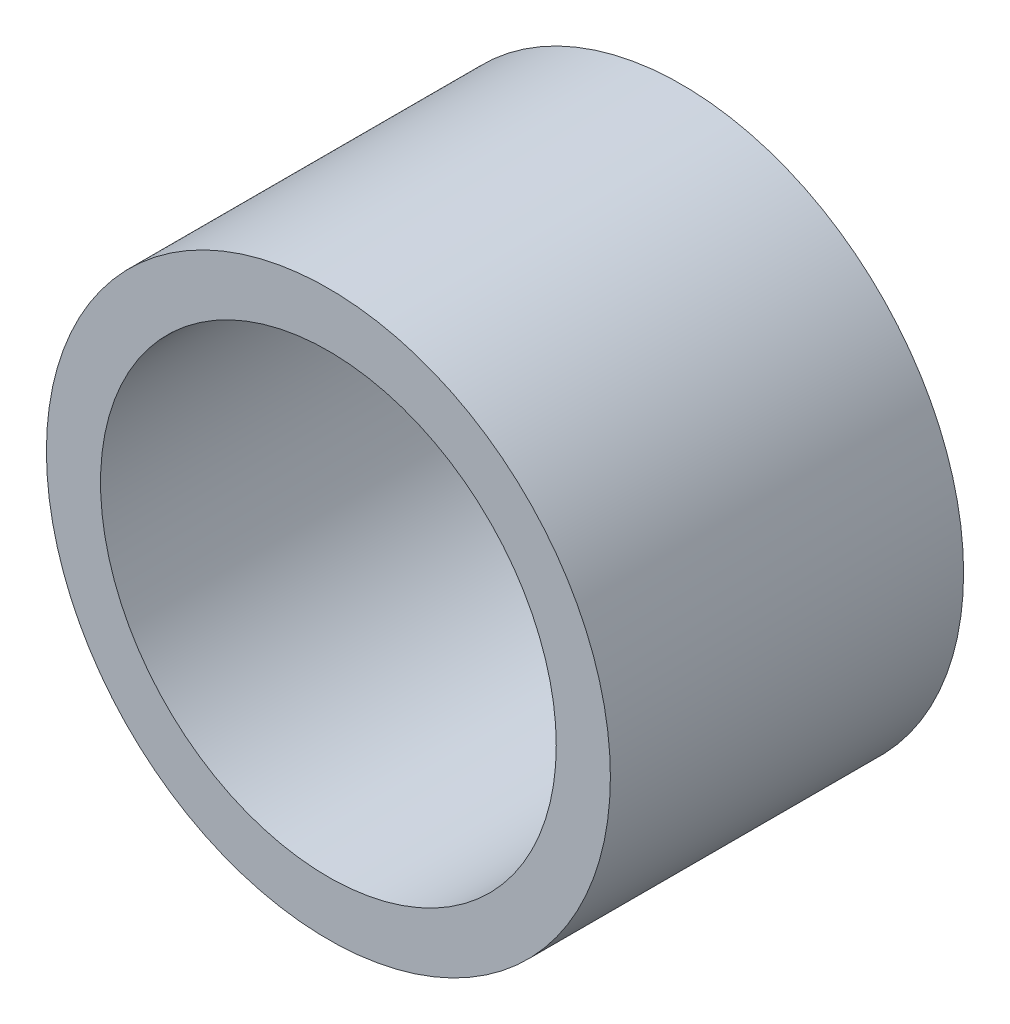
ISO-10303-21;
HEADER;
FILE_DESCRIPTION(('STEP AP214'),'2;1');
FILE_NAME('part.step','',(''),(''),'','','');
FILE_SCHEMA(('AUTOMOTIVE_DESIGN { 1 0 10303 214 1 1 1 1 }'));
ENDSEC;
DATA;
#1=APPLICATION_CONTEXT('core data for automotive mechanical design processes');
#2=APPLICATION_PROTOCOL_DEFINITION('international standard','automotive_design',2000,#1);
#3=PRODUCT_CONTEXT('',#1,'mechanical');
#4=PRODUCT('Part','Part','',(#3));
#5=PRODUCT_RELATED_PRODUCT_CATEGORY('part','',(#4));
#6=PRODUCT_DEFINITION_FORMATION('','',#4);
#7=PRODUCT_DEFINITION_CONTEXT('part definition',#1,'design');
#8=PRODUCT_DEFINITION('design','',#6,#7);
#9=PRODUCT_DEFINITION_SHAPE('','',#8);
#10=(LENGTH_UNIT() NAMED_UNIT(*) SI_UNIT(.MILLI.,.METRE.));
#11=(NAMED_UNIT(*) PLANE_ANGLE_UNIT() SI_UNIT($,.RADIAN.));
#12=(NAMED_UNIT(*) SI_UNIT($,.STERADIAN.) SOLID_ANGLE_UNIT());
#13=UNCERTAINTY_MEASURE_WITH_UNIT(LENGTH_MEASURE(1.E-05),#10,'distance_accuracy_value','');
#14=(GEOMETRIC_REPRESENTATION_CONTEXT(3) GLOBAL_UNCERTAINTY_ASSIGNED_CONTEXT((#13)) GLOBAL_UNIT_ASSIGNED_CONTEXT((#10,
#11,#12)) REPRESENTATION_CONTEXT('',''));
#15=CARTESIAN_POINT('',(0.,0.,0.));
#16=DIRECTION('',(0.,0.,1.));
#17=DIRECTION('',(1.,0.,0.));
#18=AXIS2_PLACEMENT_3D('',#15,#16,#17);
#19=CARTESIAN_POINT('',(0.,0.,7.874));
#20=DIRECTION('',(0.,0.,1.));
#21=DIRECTION('',(1.,0.,0.));
#22=AXIS2_PLACEMENT_3D('',#19,#20,#21);
#23=PLANE('',#22);
#24=CARTESIAN_POINT('',(0.,0.,7.874));
#25=DIRECTION('',(0.,0.,1.));
#26=DIRECTION('',(1.,0.,0.));
#27=AXIS2_PLACEMENT_3D('',#24,#25,#26);
#28=CIRCLE('',#27,6.2865);
#29=CARTESIAN_POINT('',(6.2865,0.,7.874));
#30=VERTEX_POINT('',#29);
#31=EDGE_CURVE('E12',#30,#30,#28,.T.);
#32=ORIENTED_EDGE('',*,*,#31,.T.);
#33=EDGE_LOOP('',(#32));
#34=FACE_BOUND('',#33,.T.);
#35=CARTESIAN_POINT('',(0.,0.,7.874));
#36=DIRECTION('',(0.,0.,1.));
#37=DIRECTION('',(1.,0.,0.));
#38=AXIS2_PLACEMENT_3D('',#35,#36,#37);
#39=CIRCLE('',#38,5.08);
#40=CARTESIAN_POINT('',(5.08,0.,7.874));
#41=VERTEX_POINT('',#40);
#42=EDGE_CURVE('E49',#41,#41,#39,.T.);
#43=ORIENTED_EDGE('',*,*,#42,.F.);
#44=EDGE_LOOP('',(#43));
#45=FACE_BOUND('',#44,.T.);
#46=ADVANCED_FACE('F38',(#34,#45),#23,.T.);
#47=CARTESIAN_POINT('',(0.,0.,0.));
#48=DIRECTION('',(0.,0.,1.));
#49=DIRECTION('',(1.,0.,0.));
#50=AXIS2_PLACEMENT_3D('',#47,#48,#49);
#51=PLANE('',#50);
#52=CARTESIAN_POINT('',(0.,0.,0.));
#53=DIRECTION('',(0.,0.,1.));
#54=DIRECTION('',(1.,0.,0.));
#55=AXIS2_PLACEMENT_3D('',#52,#53,#54);
#56=CIRCLE('',#55,6.2865);
#57=CARTESIAN_POINT('',(6.2865,0.,0.));
#58=VERTEX_POINT('',#57);
#59=EDGE_CURVE('E42',#58,#58,#56,.T.);
#60=ORIENTED_EDGE('',*,*,#59,.F.);
#61=EDGE_LOOP('',(#60));
#62=FACE_BOUND('',#61,.T.);
#63=CARTESIAN_POINT('',(0.,0.,0.));
#64=DIRECTION('',(0.,0.,1.));
#65=DIRECTION('',(1.,0.,0.));
#66=AXIS2_PLACEMENT_3D('',#63,#64,#65);
#67=CIRCLE('',#66,5.08);
#68=CARTESIAN_POINT('',(5.08,0.,0.));
#69=VERTEX_POINT('',#68);
#70=EDGE_CURVE('E51',#69,#69,#67,.T.);
#71=ORIENTED_EDGE('',*,*,#70,.T.);
#72=EDGE_LOOP('',(#71));
#73=FACE_BOUND('',#72,.T.);
#74=ADVANCED_FACE('F61',(#62,#73),#51,.F.);
#75=CARTESIAN_POINT('',(0.,0.,7.874));
#76=DIRECTION('',(0.,0.,-1.));
#77=DIRECTION('',(-1.,0.,0.));
#78=AXIS2_PLACEMENT_3D('',#75,#76,#77);
#79=CYLINDRICAL_SURFACE('',#78,6.2865);
#80=ORIENTED_EDGE('',*,*,#31,.F.);
#81=EDGE_LOOP('',(#80));
#82=FACE_BOUND('',#81,.T.);
#83=ORIENTED_EDGE('',*,*,#59,.T.);
#84=EDGE_LOOP('',(#83));
#85=FACE_BOUND('',#84,.T.);
#86=ADVANCED_FACE('F40',(#82,#85),#79,.T.);
#87=CARTESIAN_POINT('',(0.,0.,7.874));
#88=DIRECTION('',(0.,0.,-1.));
#89=DIRECTION('',(-1.,0.,0.));
#90=AXIS2_PLACEMENT_3D('',#87,#88,#89);
#91=CYLINDRICAL_SURFACE('',#90,5.08);
#92=ORIENTED_EDGE('',*,*,#42,.T.);
#93=EDGE_LOOP('',(#92));
#94=FACE_BOUND('',#93,.T.);
#95=ORIENTED_EDGE('',*,*,#70,.F.);
#96=EDGE_LOOP('',(#95));
#97=FACE_BOUND('',#96,.T.);
#98=ADVANCED_FACE('F57',(#94,#97),#91,.F.);
#99=CLOSED_SHELL('',(#46,#74,#86,#98));
#100=MANIFOLD_SOLID_BREP('B2',#99);
#101=ADVANCED_BREP_SHAPE_REPRESENTATION('',(#18,#100),#14);
#102=SHAPE_DEFINITION_REPRESENTATION(#9,#101);
ENDSEC;
END-ISO-10303-21;
